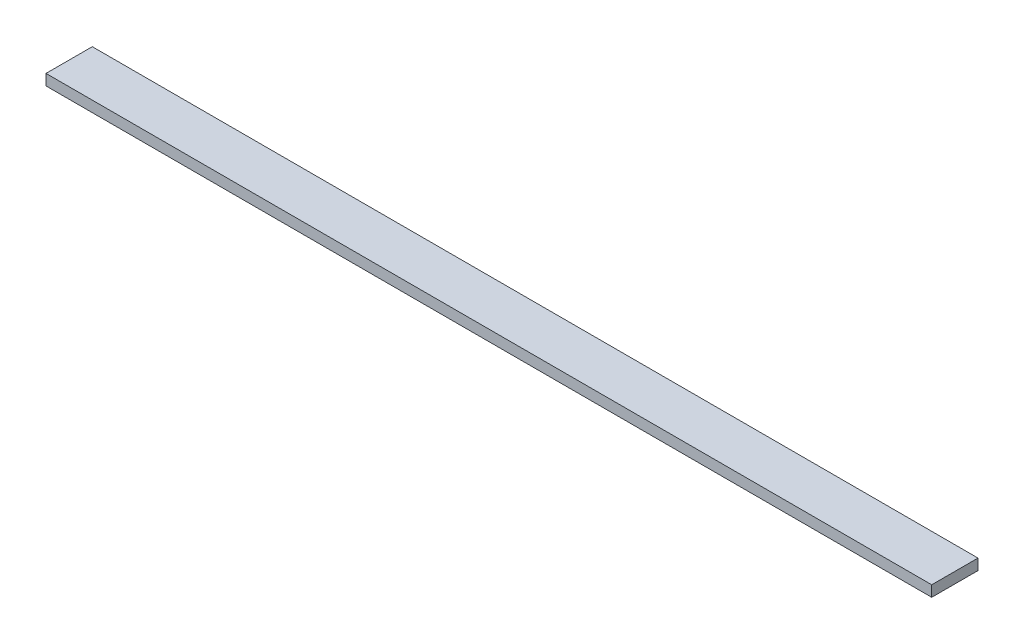
ISO-10303-21;
HEADER;
FILE_DESCRIPTION(('STEP AP214'),'2;1');
FILE_NAME('part.step','',(''),(''),'','','');
FILE_SCHEMA(('AUTOMOTIVE_DESIGN { 1 0 10303 214 1 1 1 1 }'));
ENDSEC;
DATA;
#1=APPLICATION_CONTEXT('core data for automotive mechanical design processes');
#2=APPLICATION_PROTOCOL_DEFINITION('international standard','automotive_design',2000,#1);
#3=PRODUCT_CONTEXT('',#1,'mechanical');
#4=PRODUCT('Part','Part','',(#3));
#5=PRODUCT_RELATED_PRODUCT_CATEGORY('part','',(#4));
#6=PRODUCT_DEFINITION_FORMATION('','',#4);
#7=PRODUCT_DEFINITION_CONTEXT('part definition',#1,'design');
#8=PRODUCT_DEFINITION('design','',#6,#7);
#9=PRODUCT_DEFINITION_SHAPE('','',#8);
#10=(LENGTH_UNIT() NAMED_UNIT(*) SI_UNIT(.MILLI.,.METRE.));
#11=(NAMED_UNIT(*) PLANE_ANGLE_UNIT() SI_UNIT($,.RADIAN.));
#12=(NAMED_UNIT(*) SI_UNIT($,.STERADIAN.) SOLID_ANGLE_UNIT());
#13=UNCERTAINTY_MEASURE_WITH_UNIT(LENGTH_MEASURE(1.E-05),#10,'distance_accuracy_value','');
#14=(GEOMETRIC_REPRESENTATION_CONTEXT(3) GLOBAL_UNCERTAINTY_ASSIGNED_CONTEXT((#13)) GLOBAL_UNIT_ASSIGNED_CONTEXT((#10,
#11,#12)) REPRESENTATION_CONTEXT('',''));
#15=CARTESIAN_POINT('',(0.,0.,0.));
#16=DIRECTION('',(0.,0.,1.));
#17=DIRECTION('',(1.,0.,0.));
#18=AXIS2_PLACEMENT_3D('',#15,#16,#17);
#19=CARTESIAN_POINT('',(486.156,11.938,25.4));
#20=DIRECTION('',(-1.,0.,0.));
#21=DIRECTION('',(0.,0.,1.));
#22=AXIS2_PLACEMENT_3D('',#19,#20,#21);
#23=PLANE('',#22);
#24=DIRECTION('',(0.,0.,-1.));
#25=VECTOR('',#24,1.);
#26=CARTESIAN_POINT('',(486.156,0.,25.4));
#27=LINE('',#26,#25);
#28=CARTESIAN_POINT('',(486.156,0.,25.4));
#29=VERTEX_POINT('',#28);
#30=CARTESIAN_POINT('',(486.156,0.,-25.4));
#31=VERTEX_POINT('',#30);
#32=EDGE_CURVE('E96',#29,#31,#27,.T.);
#33=ORIENTED_EDGE('',*,*,#32,.T.);
#34=DIRECTION('',(0.,-1.,0.));
#35=VECTOR('',#34,1.);
#36=CARTESIAN_POINT('',(486.156,11.938,-25.4));
#37=LINE('',#36,#35);
#38=CARTESIAN_POINT('',(486.156,11.938,-25.4));
#39=VERTEX_POINT('',#38);
#40=EDGE_CURVE('E11',#39,#31,#37,.T.);
#41=ORIENTED_EDGE('',*,*,#40,.F.);
#42=DIRECTION('',(0.,0.,-1.));
#43=VECTOR('',#42,1.);
#44=CARTESIAN_POINT('',(486.156,11.938,25.4));
#45=LINE('',#44,#43);
#46=CARTESIAN_POINT('',(486.156,11.938,25.4));
#47=VERTEX_POINT('',#46);
#48=EDGE_CURVE('E84',#47,#39,#45,.T.);
#49=ORIENTED_EDGE('',*,*,#48,.F.);
#50=DIRECTION('',(0.,-1.,0.));
#51=VECTOR('',#50,1.);
#52=CARTESIAN_POINT('',(486.156,11.938,25.4));
#53=LINE('',#52,#51);
#54=EDGE_CURVE('E92',#47,#29,#53,.T.);
#55=ORIENTED_EDGE('',*,*,#54,.T.);
#56=EDGE_LOOP('',(#33,#41,#49,#55));
#57=FACE_BOUND('',#56,.T.);
#58=ADVANCED_FACE('F33',(#57),#23,.F.);
#59=CARTESIAN_POINT('',(-486.156,11.938,-25.4));
#60=DIRECTION('',(0.,0.,1.));
#61=DIRECTION('',(1.,0.,0.));
#62=AXIS2_PLACEMENT_3D('',#59,#60,#61);
#63=PLANE('',#62);
#64=DIRECTION('',(-1.,0.,0.));
#65=VECTOR('',#64,1.);
#66=CARTESIAN_POINT('',(-486.156,0.,-25.4));
#67=LINE('',#66,#65);
#68=CARTESIAN_POINT('',(-486.156,0.,-25.4));
#69=VERTEX_POINT('',#68);
#70=EDGE_CURVE('E88',#31,#69,#67,.T.);
#71=ORIENTED_EDGE('',*,*,#70,.T.);
#72=DIRECTION('',(0.,-1.,0.));
#73=VECTOR('',#72,1.);
#74=CARTESIAN_POINT('',(-486.156,11.938,-25.4));
#75=LINE('',#74,#73);
#76=CARTESIAN_POINT('',(-486.156,11.938,-25.4));
#77=VERTEX_POINT('',#76);
#78=EDGE_CURVE('E41',#77,#69,#75,.T.);
#79=ORIENTED_EDGE('',*,*,#78,.F.);
#80=DIRECTION('',(-1.,0.,0.));
#81=VECTOR('',#80,1.);
#82=CARTESIAN_POINT('',(-486.156,11.938,-25.4));
#83=LINE('',#82,#81);
#84=EDGE_CURVE('E79',#39,#77,#83,.T.);
#85=ORIENTED_EDGE('',*,*,#84,.F.);
#86=ORIENTED_EDGE('',*,*,#40,.T.);
#87=EDGE_LOOP('',(#71,#79,#85,#86));
#88=FACE_BOUND('',#87,.T.);
#89=ADVANCED_FACE('F87',(#88),#63,.F.);
#90=CARTESIAN_POINT('',(-486.156,11.938,25.4));
#91=DIRECTION('',(1.,0.,0.));
#92=DIRECTION('',(0.,0.,-1.));
#93=AXIS2_PLACEMENT_3D('',#90,#91,#92);
#94=PLANE('',#93);
#95=DIRECTION('',(0.,0.,1.));
#96=VECTOR('',#95,1.);
#97=CARTESIAN_POINT('',(-486.156,0.,25.4));
#98=LINE('',#97,#96);
#99=CARTESIAN_POINT('',(-486.156,0.,25.4));
#100=VERTEX_POINT('',#99);
#101=EDGE_CURVE('E66',#69,#100,#98,.T.);
#102=ORIENTED_EDGE('',*,*,#101,.T.);
#103=DIRECTION('',(0.,-1.,0.));
#104=VECTOR('',#103,1.);
#105=CARTESIAN_POINT('',(-486.156,11.938,25.4));
#106=LINE('',#105,#104);
#107=CARTESIAN_POINT('',(-486.156,11.938,25.4));
#108=VERTEX_POINT('',#107);
#109=EDGE_CURVE('E89',#108,#100,#106,.T.);
#110=ORIENTED_EDGE('',*,*,#109,.F.);
#111=DIRECTION('',(0.,0.,1.));
#112=VECTOR('',#111,1.);
#113=CARTESIAN_POINT('',(-486.156,11.938,25.4));
#114=LINE('',#113,#112);
#115=EDGE_CURVE('E82',#77,#108,#114,.T.);
#116=ORIENTED_EDGE('',*,*,#115,.F.);
#117=ORIENTED_EDGE('',*,*,#78,.T.);
#118=EDGE_LOOP('',(#102,#110,#116,#117));
#119=FACE_BOUND('',#118,.T.);
#120=ADVANCED_FACE('F90',(#119),#94,.F.);
#121=CARTESIAN_POINT('',(-486.156,11.938,25.4));
#122=DIRECTION('',(0.,0.,-1.));
#123=DIRECTION('',(-1.,0.,0.));
#124=AXIS2_PLACEMENT_3D('',#121,#122,#123);
#125=PLANE('',#124);
#126=DIRECTION('',(1.,0.,0.));
#127=VECTOR('',#126,1.);
#128=CARTESIAN_POINT('',(-486.156,0.,25.4));
#129=LINE('',#128,#127);
#130=EDGE_CURVE('E72',#100,#29,#129,.T.);
#131=ORIENTED_EDGE('',*,*,#130,.T.);
#132=ORIENTED_EDGE('',*,*,#54,.F.);
#133=DIRECTION('',(1.,0.,0.));
#134=VECTOR('',#133,1.);
#135=CARTESIAN_POINT('',(-486.156,11.938,25.4));
#136=LINE('',#135,#134);
#137=EDGE_CURVE('E49',#108,#47,#136,.T.);
#138=ORIENTED_EDGE('',*,*,#137,.F.);
#139=ORIENTED_EDGE('',*,*,#109,.T.);
#140=EDGE_LOOP('',(#131,#132,#138,#139));
#141=FACE_BOUND('',#140,.T.);
#142=ADVANCED_FACE('F103',(#141),#125,.F.);
#143=CARTESIAN_POINT('',(0.,11.938,0.));
#144=DIRECTION('',(0.,-1.,0.));
#145=DIRECTION('',(0.,0.,-1.));
#146=AXIS2_PLACEMENT_3D('',#143,#144,#145);
#147=PLANE('',#146);
#148=ORIENTED_EDGE('',*,*,#48,.T.);
#149=ORIENTED_EDGE('',*,*,#84,.T.);
#150=ORIENTED_EDGE('',*,*,#115,.T.);
#151=ORIENTED_EDGE('',*,*,#137,.T.);
#152=EDGE_LOOP('',(#148,#149,#150,#151));
#153=FACE_BOUND('',#152,.T.);
#154=ADVANCED_FACE('F80',(#153),#147,.F.);
#155=CARTESIAN_POINT('',(0.,0.,0.));
#156=DIRECTION('',(0.,-1.,0.));
#157=DIRECTION('',(0.,0.,-1.));
#158=AXIS2_PLACEMENT_3D('',#155,#156,#157);
#159=PLANE('',#158);
#160=ORIENTED_EDGE('',*,*,#32,.F.);
#161=ORIENTED_EDGE('',*,*,#130,.F.);
#162=ORIENTED_EDGE('',*,*,#101,.F.);
#163=ORIENTED_EDGE('',*,*,#70,.F.);
#164=EDGE_LOOP('',(#160,#161,#162,#163));
#165=FACE_BOUND('',#164,.T.);
#166=ADVANCED_FACE('F106',(#165),#159,.T.);
#167=CLOSED_SHELL('',(#58,#89,#120,#142,#154,#166));
#168=MANIFOLD_SOLID_BREP('B2',#167);
#169=ADVANCED_BREP_SHAPE_REPRESENTATION('',(#18,#168),#14);
#170=SHAPE_DEFINITION_REPRESENTATION(#9,#169);
ENDSEC;
END-ISO-10303-21;
